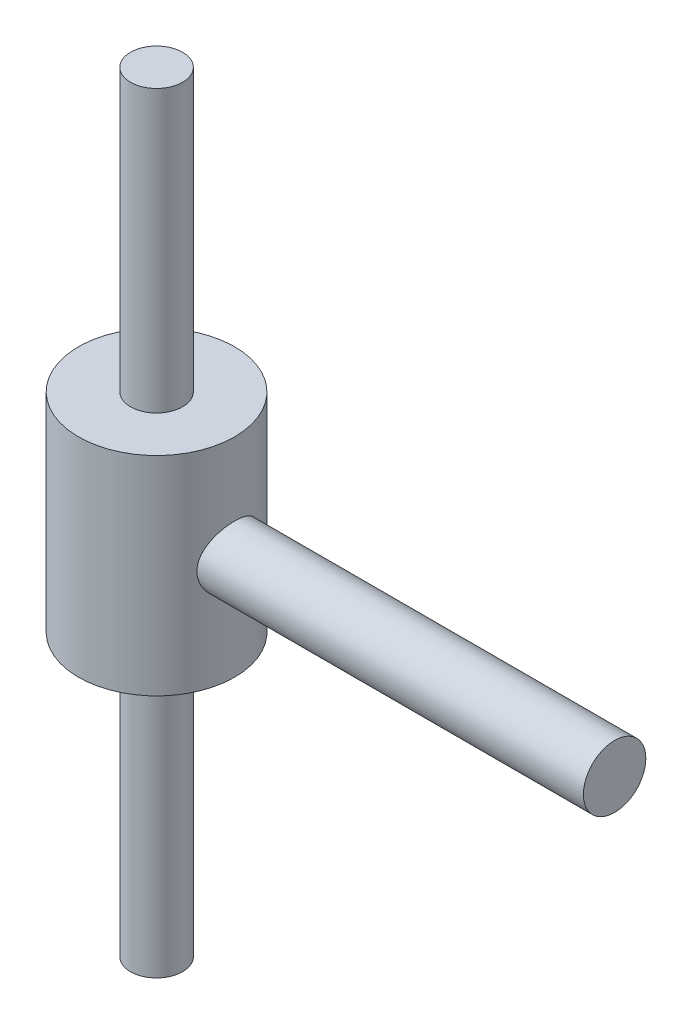
ISO-10303-21;
HEADER;
FILE_DESCRIPTION(('STEP AP214'),'2;1');
FILE_NAME('part.step','',(''),(''),'','','');
FILE_SCHEMA(('AUTOMOTIVE_DESIGN { 1 0 10303 214 1 1 1 1 }'));
ENDSEC;
DATA;
#1=APPLICATION_CONTEXT('core data for automotive mechanical design processes');
#2=APPLICATION_PROTOCOL_DEFINITION('international standard','automotive_design',2000,#1);
#3=PRODUCT_CONTEXT('',#1,'mechanical');
#4=PRODUCT('Part','Part','',(#3));
#5=PRODUCT_RELATED_PRODUCT_CATEGORY('part','',(#4));
#6=PRODUCT_DEFINITION_FORMATION('','',#4);
#7=PRODUCT_DEFINITION_CONTEXT('part definition',#1,'design');
#8=PRODUCT_DEFINITION('design','',#6,#7);
#9=PRODUCT_DEFINITION_SHAPE('','',#8);
#10=(LENGTH_UNIT() NAMED_UNIT(*) SI_UNIT(.MILLI.,.METRE.));
#11=(NAMED_UNIT(*) PLANE_ANGLE_UNIT() SI_UNIT($,.RADIAN.));
#12=(NAMED_UNIT(*) SI_UNIT($,.STERADIAN.) SOLID_ANGLE_UNIT());
#13=UNCERTAINTY_MEASURE_WITH_UNIT(LENGTH_MEASURE(1.E-05),#10,'distance_accuracy_value','');
#14=(GEOMETRIC_REPRESENTATION_CONTEXT(3) GLOBAL_UNCERTAINTY_ASSIGNED_CONTEXT((#13)) GLOBAL_UNIT_ASSIGNED_CONTEXT((#10,
#11,#12)) REPRESENTATION_CONTEXT('',''));
#15=CARTESIAN_POINT('',(0.,0.,0.));
#16=DIRECTION('',(0.,0.,1.));
#17=DIRECTION('',(1.,0.,0.));
#18=AXIS2_PLACEMENT_3D('',#15,#16,#17);
#19=CARTESIAN_POINT('',(0.,20.,0.));
#20=DIRECTION('',(0.,-1.,0.));
#21=DIRECTION('',(1.,0.,0.));
#22=AXIS2_PLACEMENT_3D('',#19,#20,#21);
#23=PLANE('',#22);
#24=CARTESIAN_POINT('',(0.,20.,0.));
#25=DIRECTION('',(0.,1.,0.));
#26=DIRECTION('',(0.,0.,1.));
#27=AXIS2_PLACEMENT_3D('',#24,#25,#26);
#28=CIRCLE('',#27,5.);
#29=CARTESIAN_POINT('',(0.,20.,5.));
#30=VERTEX_POINT('',#29);
#31=EDGE_CURVE('E11',#30,#30,#28,.T.);
#32=ORIENTED_EDGE('',*,*,#31,.F.);
#33=EDGE_LOOP('',(#32));
#34=FACE_BOUND('',#33,.T.);
#35=CARTESIAN_POINT('',(0.,20.,0.));
#36=DIRECTION('',(0.,-1.,0.));
#37=DIRECTION('',(1.,0.,0.));
#38=AXIS2_PLACEMENT_3D('',#35,#36,#37);
#39=CIRCLE('',#38,15.);
#40=CARTESIAN_POINT('',(15.,20.,0.));
#41=VERTEX_POINT('',#40);
#42=EDGE_CURVE('E82',#41,#41,#39,.T.);
#43=ORIENTED_EDGE('',*,*,#42,.F.);
#44=EDGE_LOOP('',(#43));
#45=FACE_BOUND('',#44,.T.);
#46=ADVANCED_FACE('F54',(#34,#45),#23,.F.);
#47=CARTESIAN_POINT('',(0.,-20.,0.));
#48=DIRECTION('',(0.,-1.,0.));
#49=DIRECTION('',(1.,0.,0.));
#50=AXIS2_PLACEMENT_3D('',#47,#48,#49);
#51=PLANE('',#50);
#52=CARTESIAN_POINT('',(0.,-20.,0.));
#53=DIRECTION('',(0.,-1.,0.));
#54=DIRECTION('',(0.,0.,-1.));
#55=AXIS2_PLACEMENT_3D('',#52,#53,#54);
#56=CIRCLE('',#55,5.);
#57=CARTESIAN_POINT('',(0.,-20.,-5.));
#58=VERTEX_POINT('',#57);
#59=EDGE_CURVE('E66',#58,#58,#56,.T.);
#60=ORIENTED_EDGE('',*,*,#59,.F.);
#61=EDGE_LOOP('',(#60));
#62=FACE_BOUND('',#61,.T.);
#63=CARTESIAN_POINT('',(0.,-20.,0.));
#64=DIRECTION('',(0.,-1.,0.));
#65=DIRECTION('',(1.,0.,0.));
#66=AXIS2_PLACEMENT_3D('',#63,#64,#65);
#67=CIRCLE('',#66,15.);
#68=CARTESIAN_POINT('',(15.,-20.,0.));
#69=VERTEX_POINT('',#68);
#70=EDGE_CURVE('E84',#69,#69,#67,.T.);
#71=ORIENTED_EDGE('',*,*,#70,.T.);
#72=EDGE_LOOP('',(#71));
#73=FACE_BOUND('',#72,.T.);
#74=ADVANCED_FACE('F98',(#62,#73),#51,.T.);
#75=CARTESIAN_POINT('',(0.,20.,0.));
#76=DIRECTION('',(0.,-1.,0.));
#77=DIRECTION('',(1.,0.,0.));
#78=AXIS2_PLACEMENT_3D('',#75,#76,#77);
#79=CYLINDRICAL_SURFACE('',#78,15.);
#80=CARTESIAN_POINT('',(15.,6.,0.));
#81=CARTESIAN_POINT('',(14.9999992799423,5.99999907633706,0.161313644504795));
#82=CARTESIAN_POINT('',(14.9973905442872,5.99348550139582,0.322689516963508));
#83=CARTESIAN_POINT('',(14.9870209396163,5.96748987821247,0.644299623195491));
#84=CARTESIAN_POINT('',(14.9792566295469,5.94799916844521,0.80453302218813));
#85=CARTESIAN_POINT('',(14.9587594719095,5.89618961968034,1.12295032515216));
#86=CARTESIAN_POINT('',(14.9460159747332,5.86384328218401,1.28112908028619));
#87=CARTESIAN_POINT('',(14.9158923525357,5.78663177014574,1.59401110108469));
#88=CARTESIAN_POINT('',(14.8985103329152,5.741761479865,1.74871291854087));
#89=CARTESIAN_POINT('',(14.85963474988,5.64011880463919,2.05297112205075));
#90=CARTESIAN_POINT('',(14.8381566801894,5.58339119593629,2.20254446893524));
#91=CARTESIAN_POINT('',(14.7915782226374,5.45840170244081,2.49626491179011));
#92=CARTESIAN_POINT('',(14.7664764822838,5.39013550937534,2.64040995626988));
#93=CARTESIAN_POINT('',(14.7132880124765,5.24266819714285,2.92227692731373));
#94=CARTESIAN_POINT('',(14.6852036009652,5.16347555520486,3.06000372368526));
#95=CARTESIAN_POINT('',(14.6267056927006,4.99467518366883,3.32842124549353));
#96=CARTESIAN_POINT('',(14.5962913543436,4.90506368451759,3.45910939916273));
#97=CARTESIAN_POINT('',(14.4999578839521,4.61340096802569,3.8503463050522));
#98=CARTESIAN_POINT('',(14.4312855983673,4.39475150378829,4.09812078052022));
#99=CARTESIAN_POINT('',(14.2938006085538,3.91972848220131,4.55459108369286));
#100=CARTESIAN_POINT('',(14.2249878521747,3.66333657769938,4.76326779263535));
#101=CARTESIAN_POINT('',(14.1257237119283,3.24887569858755,5.04723766459798));
#102=CARTESIAN_POINT('',(14.0926348838902,3.1022648970436,5.13866506559553));
#103=CARTESIAN_POINT('',(14.0294439987206,2.8012358186711,5.30875946518037));
#104=CARTESIAN_POINT('',(13.9993407152693,2.64682078712387,5.38743171147838));
#105=CARTESIAN_POINT('',(13.9431035259271,2.33114969334845,5.53135072514937));
#106=CARTESIAN_POINT('',(13.9169698885377,2.1698931693136,5.59659658448498));
#107=CARTESIAN_POINT('',(13.8695965651366,1.84174929930482,5.71298893930062));
#108=CARTESIAN_POINT('',(13.8483544285077,1.67486482116359,5.76414249748569));
#109=CARTESIAN_POINT('',(13.8123610719611,1.34428057885177,5.84985002952935));
#110=CARTESIAN_POINT('',(13.7973611781672,1.18077440622038,5.88504634552834));
#111=CARTESIAN_POINT('',(13.7730632035884,0.851047582104778,5.94169028877152));
#112=CARTESIAN_POINT('',(13.763762547854,0.684828191369745,5.96314412514811));
#113=CARTESIAN_POINT('',(13.7511953307051,0.350984079492434,5.99206783200916));
#114=CARTESIAN_POINT('',(13.7479274945764,0.183359662748451,5.99954065663821));
#115=CARTESIAN_POINT('',(13.7475446397,-0.151929099875549,6.00041818162586));
#116=CARTESIAN_POINT('',(13.7504293339811,-0.31959344352854,5.99382353813072));
#117=CARTESIAN_POINT('',(13.7618280557533,-0.641884927740915,5.96760177471961));
#118=CARTESIAN_POINT('',(13.7699346208222,-0.796604370498162,5.94891756277296));
#119=CARTESIAN_POINT('',(13.7911192754836,-1.103840806555,5.8996396544996));
#120=CARTESIAN_POINT('',(13.8041990012772,-1.25635705783037,5.86904203850858));
#121=CARTESIAN_POINT('',(13.8349228158605,-1.55807979901831,5.79624600676145));
#122=CARTESIAN_POINT('',(13.8525658056772,-1.7072870764518,5.75405038400524));
#123=CARTESIAN_POINT('',(13.8919033105674,-2.00156268396213,5.65841794933909));
#124=CARTESIAN_POINT('',(13.9135993823432,-2.14662939897561,5.60497681726873));
#125=CARTESIAN_POINT('',(13.9608971317125,-2.43458921196665,5.48612076549079));
#126=CARTESIAN_POINT('',(13.9865682596972,-2.57738076705269,5.42048769239742));
#127=CARTESIAN_POINT('',(14.0407834641431,-2.85699543036736,5.27846344073437));
#128=CARTESIAN_POINT('',(14.0693285125008,-2.99381649693462,5.20206861926844));
#129=CARTESIAN_POINT('',(14.1285380661928,-3.26075619750076,5.03904071569064));
#130=CARTESIAN_POINT('',(14.1592028551284,-3.39087393057646,4.95240626250741));
#131=CARTESIAN_POINT('',(14.2218815851021,-3.64375143276673,4.7694272064266));
#132=CARTESIAN_POINT('',(14.2538955957211,-3.76651082161022,4.67308210238212));
#133=CARTESIAN_POINT('',(14.321009166178,-4.01328743918054,4.46337699329053));
#134=CARTESIAN_POINT('',(14.3561554862976,-4.13666401644284,4.34927691149483));
#135=CARTESIAN_POINT('',(14.4261573040414,-4.37341997604956,4.11112913327325));
#136=CARTESIAN_POINT('',(14.46101288438,-4.48680229611004,3.98708438059708));
#137=CARTESIAN_POINT('',(14.5295379121774,-4.70297656358241,3.72964838124062));
#138=CARTESIAN_POINT('',(14.563206664882,-4.80576237352026,3.59625179230496));
#139=CARTESIAN_POINT('',(14.6284304794354,-4.99993388757555,3.32099627612082));
#140=CARTESIAN_POINT('',(14.6599863831411,-5.09132414487588,3.17914076240928));
#141=CARTESIAN_POINT('',(14.7207656025778,-5.26379970633357,2.88480363244261));
#142=CARTESIAN_POINT('',(14.7499286757954,-5.34463859680639,2.73216491576377));
#143=CARTESIAN_POINT('',(14.8043518853361,-5.49305024742826,2.41997061448609));
#144=CARTESIAN_POINT('',(14.8296135908352,-5.56062834419929,2.26041784404165));
#145=CARTESIAN_POINT('',(14.875508159045,-5.68189175291899,1.93550182558386));
#146=CARTESIAN_POINT('',(14.8961419392815,-5.73557981900943,1.77013973685015));
#147=CARTESIAN_POINT('',(14.9321676804159,-5.82850487317263,1.43484781894989));
#148=CARTESIAN_POINT('',(14.9475600042365,-5.86774286179574,1.26491830691483));
#149=CARTESIAN_POINT('',(14.9718895403001,-5.92943749531374,0.932043665210945));
#150=CARTESIAN_POINT('',(14.9811550169986,-5.95275025468264,0.769280790194168));
#151=CARTESIAN_POINT('',(14.9943744084218,-5.9859416474469,0.442179347982649));
#152=CARTESIAN_POINT('',(14.9983285847944,-5.99582094260848,0.277840858808297));
#153=CARTESIAN_POINT('',(15.000814515054,-6.00203664635711,-0.0510959013325338));
#154=CARTESIAN_POINT('',(14.9993474650838,-5.99837604239609,-0.215694106984593));
#155=CARTESIAN_POINT('',(14.9910347173186,-5.97755913806226,-0.543895620115943));
#156=CARTESIAN_POINT('',(14.9841891226479,-5.96040309644145,-0.707498946609737));
#157=CARTESIAN_POINT('',(14.9657383242369,-5.91386131774214,-1.02510006060182));
#158=CARTESIAN_POINT('',(14.9543621875242,-5.88506327725836,-1.17919782151467));
#159=CARTESIAN_POINT('',(14.9271627907189,-5.81560059386885,-1.48434586639605));
#160=CARTESIAN_POINT('',(14.9113380755507,-5.77493206810542,-1.63539513588515));
#161=CARTESIAN_POINT('',(14.8756364442751,-5.68211166216053,-1.93337901855315));
#162=CARTESIAN_POINT('',(14.8557606531008,-5.62996296955663,-2.08031476115195));
#163=CARTESIAN_POINT('',(14.8124221315374,-5.51459039707872,-2.36928412673675));
#164=CARTESIAN_POINT('',(14.788958037083,-5.45136230411881,-2.51131586022716));
#165=CARTESIAN_POINT('',(14.738240986786,-5.31225631978153,-2.79382655828656));
#166=CARTESIAN_POINT('',(14.7108949918607,-5.2360540127242,-2.93412902369548));
#167=CARTESIAN_POINT('',(14.653636047145,-5.07295579131655,-3.20788342050321));
#168=CARTESIAN_POINT('',(14.6237222187979,-4.98605621255941,-3.34133298209497));
#169=CARTESIAN_POINT('',(14.5620427444402,-4.80214466849659,-3.60064969677007));
#170=CARTESIAN_POINT('',(14.5302767865174,-4.70513099772341,-3.72651556540458));
#171=CARTESIAN_POINT('',(14.4656475212144,-4.50158537994664,-3.97000140926484));
#172=CARTESIAN_POINT('',(14.4327841660717,-4.3950530183189,-4.08762102489383));
#173=CARTESIAN_POINT('',(14.3645492876992,-4.16569829883037,-4.32151965753384));
#174=CARTESIAN_POINT('',(14.3291558684875,-4.04226426963706,-4.4371933374226));
#175=CARTESIAN_POINT('',(14.2589878283471,-3.78601523693189,-4.65775251008147));
#176=CARTESIAN_POINT('',(14.2242130180919,-3.65320316765098,-4.76264135223885));
#177=CARTESIAN_POINT('',(14.1562321861325,-3.3788427625011,-4.9610580489563));
#178=CARTESIAN_POINT('',(14.1230270722696,-3.23728947765581,-5.05457937701834));
#179=CARTESIAN_POINT('',(14.0592011706988,-2.94639783208029,-5.22948651451797));
#180=CARTESIAN_POINT('',(14.0285792992444,-2.79706277899756,-5.31087742412303));
#181=CARTESIAN_POINT('',(13.9705625756139,-2.48989739915933,-5.46168285847214));
#182=CARTESIAN_POINT('',(13.9432038872192,-2.33199586936957,-5.53096653567013));
#183=CARTESIAN_POINT('',(13.8930146747533,-2.01024592899011,-5.65585321672463));
#184=CARTESIAN_POINT('',(13.8701822136217,-1.84640009801527,-5.71146207536686));
#185=CARTESIAN_POINT('',(13.8298551049057,-1.51396706306604,-5.80843082990244));
#186=CARTESIAN_POINT('',(13.8123583422014,-1.34538176688005,-5.84979637281906));
#187=CARTESIAN_POINT('',(13.7833513444251,-1.00476569762631,-5.91782050130812));
#188=CARTESIAN_POINT('',(13.7718406081887,-0.832735214250626,-5.94448031809037));
#189=CARTESIAN_POINT('',(13.755851283804,-0.49917106111771,-5.98138158194364));
#190=CARTESIAN_POINT('',(13.7509260111925,-0.337773536933933,-5.99266704417584));
#191=CARTESIAN_POINT('',(13.7467850410815,-0.0145233510541978,-6.00216046200423));
#192=CARTESIAN_POINT('',(13.7475691004247,0.147329290965074,-6.00036897454033));
#193=CARTESIAN_POINT('',(13.7548190919533,0.470211220903614,-5.98373064604634));
#194=CARTESIAN_POINT('',(13.7612843349661,0.631240606307353,-5.96888538854158));
#195=CARTESIAN_POINT('',(13.7796730336625,0.951267774979586,-5.9263097432402));
#196=CARTESIAN_POINT('',(13.7915964642388,1.11026556758983,-5.89857941471414));
#197=CARTESIAN_POINT('',(13.8199248571637,1.41879511351042,-5.83188915830646));
#198=CARTESIAN_POINT('',(13.8361324385079,1.56845168054464,-5.79342041323657));
#199=CARTESIAN_POINT('',(13.872733403532,1.86393032823804,-5.70522097391949));
#200=CARTESIAN_POINT('',(13.8931281509704,2.00975114209325,-5.6554866099175));
#201=CARTESIAN_POINT('',(13.9375216393973,2.296647321415,-5.54517998972387));
#202=CARTESIAN_POINT('',(13.9615199030744,2.43772331234237,-5.4846091686947));
#203=CARTESIAN_POINT('',(14.0124768698205,2.71441172759269,-5.35307990924357));
#204=CARTESIAN_POINT('',(14.0394366473567,2.85002214439658,-5.28211769758923));
#205=CARTESIAN_POINT('',(14.1269314560258,3.26266441378977,-5.04570156991897));
#206=CARTESIAN_POINT('',(14.1914514609348,3.52918514253622,-4.86295379872225));
#207=CARTESIAN_POINT('',(14.3239291441595,4.02905084085624,-4.45761854712721));
#208=CARTESIAN_POINT('',(14.3918878541759,4.26238577285283,-4.23501905872821));
#209=CARTESIAN_POINT('',(14.4935144880377,4.59061111426665,-3.86726006921136));
#210=CARTESIAN_POINT('',(14.5283750359907,4.69926699073618,-3.73448315683695));
#211=CARTESIAN_POINT('',(14.596218858185,4.90500130504219,-3.45982226643504));
#212=CARTESIAN_POINT('',(14.6292028182708,5.00208398697744,-3.31794165644068));
#213=CARTESIAN_POINT('',(14.692412478083,5.18404008301781,-3.02578567613311));
#214=CARTESIAN_POINT('',(14.7226355566969,5.26890193813059,-2.87550254240776));
#215=CARTESIAN_POINT('',(14.7794259622235,5.42556550371114,-2.56769193761232));
#216=CARTESIAN_POINT('',(14.8059949584405,5.49737318261118,-2.41016781863785));
#217=CARTESIAN_POINT('',(14.8542831233014,5.62611984041648,-2.09182205260198));
#218=CARTESIAN_POINT('',(14.8760814885912,5.68330479352407,-1.93111197302127));
#219=CARTESIAN_POINT('',(14.9147961660503,5.78388280551449,-1.60493222642555));
#220=CARTESIAN_POINT('',(14.931714771038,5.82728234262731,-1.43946483501729));
#221=CARTESIAN_POINT('',(14.9601501413961,5.89976280261092,-1.10541479414029));
#222=CARTESIAN_POINT('',(14.9716804678665,5.9288796810461,-0.936841087451803));
#223=CARTESIAN_POINT('',(14.9890510773976,5.97260907962451,-0.597618205770614));
#224=CARTESIAN_POINT('',(14.9948956684684,5.98723258137454,-0.426970701489369));
#225=CARTESIAN_POINT('',(14.9985429447449,5.99635639297294,-0.213390422685864));
#226=CARTESIAN_POINT('',(14.9990891025036,5.99772244129,-0.170726823310688));
#227=CARTESIAN_POINT('',(14.9998177253259,5.99954436681248,-0.0853769353554063));
#228=CARTESIAN_POINT('',(15.0000001905588,6.00000024444162,-0.0426906467858718));
#229=CARTESIAN_POINT('',(15.,6.,0.));
#230=B_SPLINE_CURVE_WITH_KNOTS('',3,(#80,#81,#82,#83,#84,#85,#86,#87,#88,#89,#90,#91,#92,#93,
#94,#95,#96,#97,#98,#99,#100,#101,#102,#103,#104,#105,#106,#107,#108,#109,#110,#111,#112,#113,
#114,#115,#116,#117,#118,#119,#120,#121,#122,#123,#124,#125,#126,#127,#128,#129,#130,#131,#132,
#133,#134,#135,#136,#137,#138,#139,#140,#141,#142,#143,#144,#145,#146,#147,#148,#149,#150,#151,
#152,#153,#154,#155,#156,#157,#158,#159,#160,#161,#162,#163,#164,#165,#166,#167,#168,#169,#170,
#171,#172,#173,#174,#175,#176,#177,#178,#179,#180,#181,#182,#183,#184,#185,#186,#187,#188,#189,
#190,#191,#192,#193,#194,#195,#196,#197,#198,#199,#200,#201,#202,#203,#204,#205,#206,#207,#208,
#209,#210,#211,#212,#213,#214,#215,#216,#217,#218,#219,#220,#221,#222,#223,#224,#225,#226,#227,
#228,#229),.UNSPECIFIED.,.T.,.F.,(4,2,2,2,2,2,2,2,2,2,2,2,2,2,2,2,2,2,2,2,2,2,2,2,2,2,2,2,2,2,2,
2,2,2,2,2,2,2,2,2,2,2,2,2,2,2,2,2,2,2,2,2,2,2,2,2,2,2,2,2,2,2,2,2,2,2,2,2,2,2,2,2,2,2,4),(0.,
0.483897054152818,0.968117407228013,1.45337914245594,1.93883938645661,2.42249849868244,
2.90633859994029,3.38980540538342,3.87344767714067,4.88128652111306,5.88961691813349,
6.41682474002603,6.94381510524777,7.47084109954819,7.99760247923351,8.50070582790118,
9.00358170358741,9.50635131114939,10.0090974686366,10.4767118882454,10.9444802892416,
11.4121361420904,11.8799719822379,12.357167111748,12.8345241636783,13.3119452055687,
13.7893908988145,14.3038604025315,14.8181781750485,15.3327921850973,15.8471999136586,
16.3720340444751,16.8966565279702,17.4211749084574,17.945656963481,18.4390821626358,
18.9324830535441,19.4257750866616,19.9190576619765,20.3900487373938,20.8611940478454,
21.3322087049456,21.8034028617177,22.2888301938794,22.7744242768985,23.2601003750447,
23.7457976390534,24.2636804561109,24.7814019482706,25.299419292813,25.8172182216539,
26.3403070717152,26.8631715731926,27.3858285361306,27.9084417339339,28.3934227501986,
28.8783831115163,29.3632846514299,29.8481839608478,30.3137727734817,30.7795134694854,
31.2451925291595,31.7110411034411,32.695156070987,33.6795680697381,34.2042554172968,
34.7287497567621,35.2537369726936,35.7784835549451,36.2937161550921,36.8087062706882,
37.3223931958723,37.8356906031082,37.9637509906823,38.0918113186414),.UNSPECIFIED.);
#231=CARTESIAN_POINT('',(15.,6.,0.));
#232=VERTEX_POINT('',#231);
#233=EDGE_CURVE('E57',#232,#232,#230,.T.);
#234=ORIENTED_EDGE('',*,*,#233,.F.);
#235=EDGE_LOOP('',(#234));
#236=FACE_BOUND('',#235,.T.);
#237=ORIENTED_EDGE('',*,*,#70,.F.);
#238=EDGE_LOOP('',(#237));
#239=FACE_BOUND('',#238,.T.);
#240=ORIENTED_EDGE('',*,*,#42,.T.);
#241=EDGE_LOOP('',(#240));
#242=FACE_BOUND('',#241,.T.);
#243=ADVANCED_FACE('F94',(#236,#239,#242),#79,.T.);
#244=CARTESIAN_POINT('',(88.,0.,0.));
#245=DIRECTION('',(1.,0.,0.));
#246=DIRECTION('',(0.,0.,-1.));
#247=AXIS2_PLACEMENT_3D('',#244,#245,#246);
#248=PLANE('',#247);
#249=CARTESIAN_POINT('',(88.,0.,0.));
#250=DIRECTION('',(1.,0.,0.));
#251=DIRECTION('',(0.,0.,-1.));
#252=AXIS2_PLACEMENT_3D('',#249,#250,#251);
#253=CIRCLE('',#252,6.);
#254=CARTESIAN_POINT('',(88.,0.,-6.));
#255=VERTEX_POINT('',#254);
#256=EDGE_CURVE('E79',#255,#255,#253,.T.);
#257=ORIENTED_EDGE('',*,*,#256,.T.);
#258=EDGE_LOOP('',(#257));
#259=FACE_BOUND('',#258,.T.);
#260=ADVANCED_FACE('F97',(#259),#248,.T.);
#261=CARTESIAN_POINT('',(0.,0.,0.));
#262=DIRECTION('',(1.,0.,0.));
#263=DIRECTION('',(0.,0.,-1.));
#264=AXIS2_PLACEMENT_3D('',#261,#262,#263);
#265=CYLINDRICAL_SURFACE('',#264,6.);
#266=ORIENTED_EDGE('',*,*,#233,.T.);
#267=EDGE_LOOP('',(#266));
#268=FACE_BOUND('',#267,.T.);
#269=ORIENTED_EDGE('',*,*,#256,.F.);
#270=EDGE_LOOP('',(#269));
#271=FACE_BOUND('',#270,.T.);
#272=ADVANCED_FACE('F91',(#268,#271),#265,.T.);
#273=CARTESIAN_POINT('',(0.,-74.,0.));
#274=DIRECTION('',(0.,-1.,0.));
#275=DIRECTION('',(0.,0.,-1.));
#276=AXIS2_PLACEMENT_3D('',#273,#274,#275);
#277=PLANE('',#276);
#278=CARTESIAN_POINT('',(0.,-74.,0.));
#279=DIRECTION('',(0.,-1.,0.));
#280=DIRECTION('',(0.,0.,-1.));
#281=AXIS2_PLACEMENT_3D('',#278,#279,#280);
#282=CIRCLE('',#281,5.);
#283=CARTESIAN_POINT('',(0.,-74.,-5.));
#284=VERTEX_POINT('',#283);
#285=EDGE_CURVE('E75',#284,#284,#282,.T.);
#286=ORIENTED_EDGE('',*,*,#285,.T.);
#287=EDGE_LOOP('',(#286));
#288=FACE_BOUND('',#287,.T.);
#289=ADVANCED_FACE('F109',(#288),#277,.T.);
#290=CARTESIAN_POINT('',(0.,-20.,0.));
#291=DIRECTION('',(0.,-1.,0.));
#292=DIRECTION('',(0.,0.,-1.));
#293=AXIS2_PLACEMENT_3D('',#290,#291,#292);
#294=CYLINDRICAL_SURFACE('',#293,5.);
#295=ORIENTED_EDGE('',*,*,#285,.F.);
#296=EDGE_LOOP('',(#295));
#297=FACE_BOUND('',#296,.T.);
#298=ORIENTED_EDGE('',*,*,#59,.T.);
#299=EDGE_LOOP('',(#298));
#300=FACE_BOUND('',#299,.T.);
#301=ADVANCED_FACE('F114',(#297,#300),#294,.T.);
#302=CARTESIAN_POINT('',(0.,74.,0.));
#303=DIRECTION('',(0.,1.,0.));
#304=DIRECTION('',(0.,0.,1.));
#305=AXIS2_PLACEMENT_3D('',#302,#303,#304);
#306=PLANE('',#305);
#307=CARTESIAN_POINT('',(0.,74.,0.));
#308=DIRECTION('',(0.,1.,0.));
#309=DIRECTION('',(0.,0.,1.));
#310=AXIS2_PLACEMENT_3D('',#307,#308,#309);
#311=CIRCLE('',#310,5.);
#312=CARTESIAN_POINT('',(0.,74.,5.));
#313=VERTEX_POINT('',#312);
#314=EDGE_CURVE('E73',#313,#313,#311,.T.);
#315=ORIENTED_EDGE('',*,*,#314,.T.);
#316=EDGE_LOOP('',(#315));
#317=FACE_BOUND('',#316,.T.);
#318=ADVANCED_FACE('F125',(#317),#306,.T.);
#319=CARTESIAN_POINT('',(0.,20.,0.));
#320=DIRECTION('',(0.,1.,0.));
#321=DIRECTION('',(0.,0.,1.));
#322=AXIS2_PLACEMENT_3D('',#319,#320,#321);
#323=CYLINDRICAL_SURFACE('',#322,5.);
#324=ORIENTED_EDGE('',*,*,#314,.F.);
#325=EDGE_LOOP('',(#324));
#326=FACE_BOUND('',#325,.T.);
#327=ORIENTED_EDGE('',*,*,#31,.T.);
#328=EDGE_LOOP('',(#327));
#329=FACE_BOUND('',#328,.T.);
#330=ADVANCED_FACE('F117',(#326,#329),#323,.T.);
#331=CLOSED_SHELL('',(#46,#74,#243,#260,#272,#289,#301,#318,#330));
#332=MANIFOLD_SOLID_BREP('B2',#331);
#333=ADVANCED_BREP_SHAPE_REPRESENTATION('',(#18,#332),#14);
#334=SHAPE_DEFINITION_REPRESENTATION(#9,#333);
ENDSEC;
END-ISO-10303-21;
